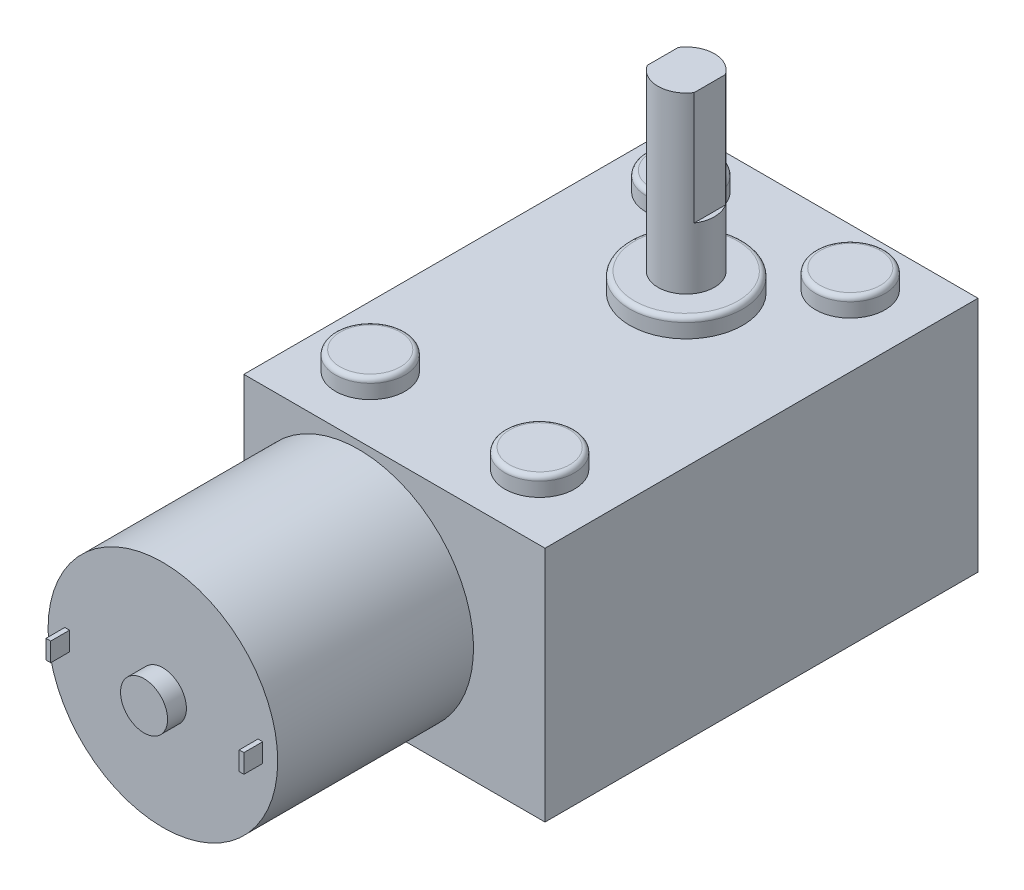
ISO-10303-21;
HEADER;
FILE_DESCRIPTION(('STEP AP214'),'2;1');
FILE_NAME('part.step','',(''),(''),'','','');
FILE_SCHEMA(('AUTOMOTIVE_DESIGN { 1 0 10303 214 1 1 1 1 }'));
ENDSEC;
DATA;
#1=APPLICATION_CONTEXT('core data for automotive mechanical design processes');
#2=APPLICATION_PROTOCOL_DEFINITION('international standard','automotive_design',2000,#1);
#3=PRODUCT_CONTEXT('',#1,'mechanical');
#4=PRODUCT('Part','Part','',(#3));
#5=PRODUCT_RELATED_PRODUCT_CATEGORY('part','',(#4));
#6=PRODUCT_DEFINITION_FORMATION('','',#4);
#7=PRODUCT_DEFINITION_CONTEXT('part definition',#1,'design');
#8=PRODUCT_DEFINITION('design','',#6,#7);
#9=PRODUCT_DEFINITION_SHAPE('','',#8);
#10=(LENGTH_UNIT() NAMED_UNIT(*) SI_UNIT(.MILLI.,.METRE.));
#11=(NAMED_UNIT(*) PLANE_ANGLE_UNIT() SI_UNIT($,.RADIAN.));
#12=(NAMED_UNIT(*) SI_UNIT($,.STERADIAN.) SOLID_ANGLE_UNIT());
#13=UNCERTAINTY_MEASURE_WITH_UNIT(LENGTH_MEASURE(1.E-05),#10,'distance_accuracy_value','');
#14=(GEOMETRIC_REPRESENTATION_CONTEXT(3) GLOBAL_UNCERTAINTY_ASSIGNED_CONTEXT((#13)) GLOBAL_UNIT_ASSIGNED_CONTEXT((#10,
#11,#12)) REPRESENTATION_CONTEXT('',''));
#15=CARTESIAN_POINT('',(0.,0.,0.));
#16=DIRECTION('',(0.,0.,1.));
#17=DIRECTION('',(1.,0.,0.));
#18=AXIS2_PLACEMENT_3D('',#15,#16,#17);
#19=CARTESIAN_POINT('',(-3.8,12.2,43.8));
#20=DIRECTION('',(0.,0.,1.));
#21=DIRECTION('',(1.,0.,0.));
#22=AXIS2_PLACEMENT_3D('',#19,#20,#21);
#23=PLANE('',#22);
#24=CARTESIAN_POINT('',(-3.8,12.2,43.8));
#25=DIRECTION('',(0.,0.,1.));
#26=DIRECTION('',(1.,0.,0.));
#27=AXIS2_PLACEMENT_3D('',#24,#25,#26);
#28=CIRCLE('',#27,2.5);
#29=CARTESIAN_POINT('',(-1.3,12.2,43.8));
#30=VERTEX_POINT('',#29);
#31=EDGE_CURVE('E194',#30,#30,#28,.T.);
#32=ORIENTED_EDGE('',*,*,#31,.F.);
#33=EDGE_LOOP('',(#32));
#34=FACE_BOUND('',#33,.T.);
#35=CARTESIAN_POINT('',(-3.8,12.2,43.8));
#36=DIRECTION('',(0.,0.,1.));
#37=DIRECTION('',(1.,0.,0.));
#38=AXIS2_PLACEMENT_3D('',#35,#36,#37);
#39=CIRCLE('',#38,12.2);
#40=CARTESIAN_POINT('',(8.4,12.2,43.8));
#41=VERTEX_POINT('',#40);
#42=EDGE_CURVE('E260',#41,#41,#39,.T.);
#43=ORIENTED_EDGE('',*,*,#42,.T.);
#44=EDGE_LOOP('',(#43));
#45=FACE_BOUND('',#44,.T.);
#46=DIRECTION('',(-1.,0.,0.));
#47=VECTOR('',#46,1.);
#48=CARTESIAN_POINT('',(6.30931544146247,13.2,43.8));
#49=LINE('',#48,#47);
#50=CARTESIAN_POINT('',(6.80931544146247,13.2,43.8));
#51=VERTEX_POINT('',#50);
#52=CARTESIAN_POINT('',(6.30931544146247,13.2,43.8));
#53=VERTEX_POINT('',#52);
#54=EDGE_CURVE('E238',#51,#53,#49,.T.);
#55=ORIENTED_EDGE('',*,*,#54,.F.);
#56=DIRECTION('',(0.,1.,0.));
#57=VECTOR('',#56,1.);
#58=CARTESIAN_POINT('',(6.80931544146247,13.2,43.8));
#59=LINE('',#58,#57);
#60=CARTESIAN_POINT('',(6.80931544146247,11.2,43.8));
#61=VERTEX_POINT('',#60);
#62=EDGE_CURVE('E224',#61,#51,#59,.T.);
#63=ORIENTED_EDGE('',*,*,#62,.F.);
#64=DIRECTION('',(1.,0.,0.));
#65=VECTOR('',#64,1.);
#66=CARTESIAN_POINT('',(6.30931544146247,11.2,43.8));
#67=LINE('',#66,#65);
#68=CARTESIAN_POINT('',(6.30931544146247,11.2,43.8));
#69=VERTEX_POINT('',#68);
#70=EDGE_CURVE('E229',#69,#61,#67,.T.);
#71=ORIENTED_EDGE('',*,*,#70,.F.);
#72=DIRECTION('',(0.,-1.,0.));
#73=VECTOR('',#72,1.);
#74=CARTESIAN_POINT('',(6.30931544146247,13.2,43.8));
#75=LINE('',#74,#73);
#76=EDGE_CURVE('E240',#53,#69,#75,.T.);
#77=ORIENTED_EDGE('',*,*,#76,.F.);
#78=EDGE_LOOP('',(#55,#63,#71,#77));
#79=FACE_BOUND('',#78,.T.);
#80=DIRECTION('',(1.,0.,0.));
#81=VECTOR('',#80,1.);
#82=CARTESIAN_POINT('',(-13.7180081843051,11.2,43.8));
#83=LINE('',#82,#81);
#84=CARTESIAN_POINT('',(-14.2180081843051,11.2,43.8));
#85=VERTEX_POINT('',#84);
#86=CARTESIAN_POINT('',(-13.7180081843051,11.2,43.8));
#87=VERTEX_POINT('',#86);
#88=EDGE_CURVE('E209',#85,#87,#83,.T.);
#89=ORIENTED_EDGE('',*,*,#88,.F.);
#90=DIRECTION('',(0.,-1.,0.));
#91=VECTOR('',#90,1.);
#92=CARTESIAN_POINT('',(-14.2180081843051,13.2,43.8));
#93=LINE('',#92,#91);
#94=CARTESIAN_POINT('',(-14.2180081843051,13.2,43.8));
#95=VERTEX_POINT('',#94);
#96=EDGE_CURVE('E206',#95,#85,#93,.T.);
#97=ORIENTED_EDGE('',*,*,#96,.F.);
#98=DIRECTION('',(-1.,0.,0.));
#99=VECTOR('',#98,1.);
#100=CARTESIAN_POINT('',(-13.7180081843051,13.2,43.8));
#101=LINE('',#100,#99);
#102=CARTESIAN_POINT('',(-13.7180081843051,13.2,43.8));
#103=VERTEX_POINT('',#102);
#104=EDGE_CURVE('E199',#103,#95,#101,.T.);
#105=ORIENTED_EDGE('',*,*,#104,.F.);
#106=DIRECTION('',(0.,1.,0.));
#107=VECTOR('',#106,1.);
#108=CARTESIAN_POINT('',(-13.7180081843051,13.2,43.8));
#109=LINE('',#108,#107);
#110=EDGE_CURVE('E211',#87,#103,#109,.T.);
#111=ORIENTED_EDGE('',*,*,#110,.F.);
#112=EDGE_LOOP('',(#89,#97,#105,#111));
#113=FACE_BOUND('',#112,.T.);
#114=ADVANCED_FACE('F36',(#34,#45,#79,#113),#23,.T.);
#115=CARTESIAN_POINT('',(0.,25.2,23.));
#116=DIRECTION('',(0.,0.,-1.));
#117=DIRECTION('',(-1.,0.,0.));
#118=AXIS2_PLACEMENT_3D('',#115,#116,#117);
#119=PLANE('',#118);
#120=CARTESIAN_POINT('',(-3.8,12.2,23.));
#121=DIRECTION('',(0.,0.,1.));
#122=DIRECTION('',(1.,0.,0.));
#123=AXIS2_PLACEMENT_3D('',#120,#121,#122);
#124=CIRCLE('',#123,12.2);
#125=CARTESIAN_POINT('',(-16.,12.2,23.));
#126=VERTEX_POINT('',#125);
#127=CARTESIAN_POINT('',(-3.8,0.,23.));
#128=VERTEX_POINT('',#127);
#129=EDGE_CURVE('E256',#126,#128,#124,.T.);
#130=ORIENTED_EDGE('',*,*,#129,.F.);
#131=DIRECTION('',(0.,-1.,0.));
#132=VECTOR('',#131,1.);
#133=CARTESIAN_POINT('',(-16.,25.2,23.));
#134=LINE('',#133,#132);
#135=CARTESIAN_POINT('',(-16.,0.,23.));
#136=VERTEX_POINT('',#135);
#137=EDGE_CURVE('E293',#126,#136,#134,.T.);
#138=ORIENTED_EDGE('',*,*,#137,.T.);
#139=DIRECTION('',(1.,0.,0.));
#140=VECTOR('',#139,1.);
#141=CARTESIAN_POINT('',(0.,0.,23.));
#142=LINE('',#141,#140);
#143=EDGE_CURVE('E294',#136,#128,#142,.T.);
#144=ORIENTED_EDGE('',*,*,#143,.T.);
#145=EDGE_LOOP('',(#130,#138,#144));
#146=FACE_BOUND('',#145,.T.);
#147=ADVANCED_FACE('F351',(#146),#119,.F.);
#148=EDGE_CURVE('E259',#128,#126,#124,.T.);
#149=ORIENTED_EDGE('',*,*,#148,.F.);
#150=CARTESIAN_POINT('',(16.,0.,23.));
#151=VERTEX_POINT('',#150);
#152=EDGE_CURVE('E280',#128,#151,#142,.T.);
#153=ORIENTED_EDGE('',*,*,#152,.T.);
#154=DIRECTION('',(0.,-1.,0.));
#155=VECTOR('',#154,1.);
#156=CARTESIAN_POINT('',(16.,25.2,23.));
#157=LINE('',#156,#155);
#158=CARTESIAN_POINT('',(16.,25.2,23.));
#159=VERTEX_POINT('',#158);
#160=EDGE_CURVE('E311',#159,#151,#157,.T.);
#161=ORIENTED_EDGE('',*,*,#160,.F.);
#162=DIRECTION('',(1.,0.,0.));
#163=VECTOR('',#162,1.);
#164=CARTESIAN_POINT('',(0.,25.2,23.));
#165=LINE('',#164,#163);
#166=CARTESIAN_POINT('',(-16.,25.2,23.));
#167=VERTEX_POINT('',#166);
#168=EDGE_CURVE('E281',#167,#159,#165,.T.);
#169=ORIENTED_EDGE('',*,*,#168,.F.);
#170=EDGE_CURVE('E305',#167,#126,#134,.T.);
#171=ORIENTED_EDGE('',*,*,#170,.T.);
#172=EDGE_LOOP('',(#149,#153,#161,#169,#171));
#173=FACE_BOUND('',#172,.T.);
#174=ADVANCED_FACE('F357',(#173),#119,.F.);
#175=CARTESIAN_POINT('',(16.,25.2,0.));
#176=DIRECTION('',(-1.,0.,0.));
#177=DIRECTION('',(0.,0.,1.));
#178=AXIS2_PLACEMENT_3D('',#175,#176,#177);
#179=PLANE('',#178);
#180=DIRECTION('',(0.,0.,-1.));
#181=VECTOR('',#180,1.);
#182=CARTESIAN_POINT('',(16.,0.,0.));
#183=LINE('',#182,#181);
#184=CARTESIAN_POINT('',(16.,0.,-23.));
#185=VERTEX_POINT('',#184);
#186=EDGE_CURVE('E297',#151,#185,#183,.T.);
#187=ORIENTED_EDGE('',*,*,#186,.T.);
#188=DIRECTION('',(0.,-1.,0.));
#189=VECTOR('',#188,1.);
#190=CARTESIAN_POINT('',(16.,25.2,-23.));
#191=LINE('',#190,#189);
#192=CARTESIAN_POINT('',(16.,25.2,-23.));
#193=VERTEX_POINT('',#192);
#194=EDGE_CURVE('E309',#193,#185,#191,.T.);
#195=ORIENTED_EDGE('',*,*,#194,.F.);
#196=DIRECTION('',(0.,0.,-1.));
#197=VECTOR('',#196,1.);
#198=CARTESIAN_POINT('',(16.,25.2,0.));
#199=LINE('',#198,#197);
#200=EDGE_CURVE('E284',#159,#193,#199,.T.);
#201=ORIENTED_EDGE('',*,*,#200,.F.);
#202=ORIENTED_EDGE('',*,*,#160,.T.);
#203=EDGE_LOOP('',(#187,#195,#201,#202));
#204=FACE_BOUND('',#203,.T.);
#205=ADVANCED_FACE('F423',(#204),#179,.F.);
#206=CARTESIAN_POINT('',(0.,25.2,-23.));
#207=DIRECTION('',(0.,0.,-1.));
#208=DIRECTION('',(-1.,0.,0.));
#209=AXIS2_PLACEMENT_3D('',#206,#207,#208);
#210=PLANE('',#209);
#211=DIRECTION('',(1.,0.,0.));
#212=VECTOR('',#211,1.);
#213=CARTESIAN_POINT('',(0.,0.,-23.));
#214=LINE('',#213,#212);
#215=CARTESIAN_POINT('',(-16.,0.,-23.));
#216=VERTEX_POINT('',#215);
#217=EDGE_CURVE('E300',#216,#185,#214,.T.);
#218=ORIENTED_EDGE('',*,*,#217,.F.);
#219=DIRECTION('',(0.,-1.,0.));
#220=VECTOR('',#219,1.);
#221=CARTESIAN_POINT('',(-16.,25.2,-23.));
#222=LINE('',#221,#220);
#223=CARTESIAN_POINT('',(-16.,25.2,-23.));
#224=VERTEX_POINT('',#223);
#225=EDGE_CURVE('E307',#224,#216,#222,.T.);
#226=ORIENTED_EDGE('',*,*,#225,.F.);
#227=DIRECTION('',(1.,0.,0.));
#228=VECTOR('',#227,1.);
#229=CARTESIAN_POINT('',(0.,25.2,-23.));
#230=LINE('',#229,#228);
#231=EDGE_CURVE('E287',#224,#193,#230,.T.);
#232=ORIENTED_EDGE('',*,*,#231,.T.);
#233=ORIENTED_EDGE('',*,*,#194,.T.);
#234=EDGE_LOOP('',(#218,#226,#232,#233));
#235=FACE_BOUND('',#234,.T.);
#236=ADVANCED_FACE('F419',(#235),#210,.T.);
#237=CARTESIAN_POINT('',(-16.,25.2,0.));
#238=DIRECTION('',(-1.,0.,0.));
#239=DIRECTION('',(0.,0.,1.));
#240=AXIS2_PLACEMENT_3D('',#237,#238,#239);
#241=PLANE('',#240);
#242=DIRECTION('',(0.,0.,-1.));
#243=VECTOR('',#242,1.);
#244=CARTESIAN_POINT('',(-16.,0.,0.));
#245=LINE('',#244,#243);
#246=EDGE_CURVE('E285',#136,#216,#245,.T.);
#247=ORIENTED_EDGE('',*,*,#246,.F.);
#248=ORIENTED_EDGE('',*,*,#137,.F.);
#249=ORIENTED_EDGE('',*,*,#170,.F.);
#250=DIRECTION('',(0.,0.,-1.));
#251=VECTOR('',#250,1.);
#252=CARTESIAN_POINT('',(-16.,25.2,0.));
#253=LINE('',#252,#251);
#254=EDGE_CURVE('E290',#167,#224,#253,.T.);
#255=ORIENTED_EDGE('',*,*,#254,.T.);
#256=ORIENTED_EDGE('',*,*,#225,.T.);
#257=EDGE_LOOP('',(#247,#248,#249,#255,#256));
#258=FACE_BOUND('',#257,.T.);
#259=ADVANCED_FACE('F412',(#258),#241,.T.);
#260=CARTESIAN_POINT('',(0.,25.2,0.));
#261=DIRECTION('',(0.,1.,0.));
#262=DIRECTION('',(0.,0.,1.));
#263=AXIS2_PLACEMENT_3D('',#260,#261,#262);
#264=PLANE('',#263);
#265=CARTESIAN_POINT('',(0.,25.2,-8.));
#266=DIRECTION('',(0.,1.,0.));
#267=DIRECTION('',(0.,0.,1.));
#268=AXIS2_PLACEMENT_3D('',#265,#266,#267);
#269=CIRCLE('',#268,6.);
#270=CARTESIAN_POINT('',(0.,25.2,-2.));
#271=VERTEX_POINT('',#270);
#272=EDGE_CURVE('E263',#271,#271,#269,.T.);
#273=ORIENTED_EDGE('',*,*,#272,.F.);
#274=EDGE_LOOP('',(#273));
#275=FACE_BOUND('',#274,.T.);
#276=CARTESIAN_POINT('',(-9.56913183279743,25.2,16.));
#277=DIRECTION('',(0.,1.,0.));
#278=DIRECTION('',(0.,0.,1.));
#279=AXIS2_PLACEMENT_3D('',#276,#277,#278);
#280=CIRCLE('',#279,3.7);
#281=CARTESIAN_POINT('',(-9.56913183279743,25.2,19.7));
#282=VERTEX_POINT('',#281);
#283=EDGE_CURVE('E268',#282,#282,#280,.T.);
#284=ORIENTED_EDGE('',*,*,#283,.F.);
#285=EDGE_LOOP('',(#284));
#286=FACE_BOUND('',#285,.T.);
#287=CARTESIAN_POINT('',(8.43086816720256,25.2,16.));
#288=DIRECTION('',(0.,1.,0.));
#289=DIRECTION('',(0.,0.,1.));
#290=AXIS2_PLACEMENT_3D('',#287,#288,#289);
#291=CIRCLE('',#290,3.7);
#292=CARTESIAN_POINT('',(8.43086816720256,25.2,19.7));
#293=VERTEX_POINT('',#292);
#294=EDGE_CURVE('E271',#293,#293,#291,.T.);
#295=ORIENTED_EDGE('',*,*,#294,.F.);
#296=EDGE_LOOP('',(#295));
#297=FACE_BOUND('',#296,.T.);
#298=CARTESIAN_POINT('',(8.43086816720256,25.2,-17.));
#299=DIRECTION('',(0.,1.,0.));
#300=DIRECTION('',(0.,0.,1.));
#301=AXIS2_PLACEMENT_3D('',#298,#299,#300);
#302=CIRCLE('',#301,3.7);
#303=CARTESIAN_POINT('',(8.43086816720256,25.2,-13.3));
#304=VERTEX_POINT('',#303);
#305=EDGE_CURVE('E274',#304,#304,#302,.T.);
#306=ORIENTED_EDGE('',*,*,#305,.F.);
#307=EDGE_LOOP('',(#306));
#308=FACE_BOUND('',#307,.T.);
#309=CARTESIAN_POINT('',(-9.56913183279743,25.2,-17.));
#310=DIRECTION('',(0.,1.,0.));
#311=DIRECTION('',(0.,0.,1.));
#312=AXIS2_PLACEMENT_3D('',#309,#310,#311);
#313=CIRCLE('',#312,3.7);
#314=CARTESIAN_POINT('',(-9.56913183279743,25.2,-13.3));
#315=VERTEX_POINT('',#314);
#316=EDGE_CURVE('E277',#315,#315,#313,.T.);
#317=ORIENTED_EDGE('',*,*,#316,.F.);
#318=EDGE_LOOP('',(#317));
#319=FACE_BOUND('',#318,.T.);
#320=ORIENTED_EDGE('',*,*,#168,.T.);
#321=ORIENTED_EDGE('',*,*,#200,.T.);
#322=ORIENTED_EDGE('',*,*,#231,.F.);
#323=ORIENTED_EDGE('',*,*,#254,.F.);
#324=EDGE_LOOP('',(#320,#321,#322,#323));
#325=FACE_BOUND('',#324,.T.);
#326=ADVANCED_FACE('F409',(#275,#286,#297,#308,#319,#325),#264,.T.);
#327=CARTESIAN_POINT('',(0.,0.,0.));
#328=DIRECTION('',(0.,1.,0.));
#329=DIRECTION('',(0.,0.,1.));
#330=AXIS2_PLACEMENT_3D('',#327,#328,#329);
#331=PLANE('',#330);
#332=ORIENTED_EDGE('',*,*,#143,.F.);
#333=ORIENTED_EDGE('',*,*,#246,.T.);
#334=ORIENTED_EDGE('',*,*,#217,.T.);
#335=ORIENTED_EDGE('',*,*,#186,.F.);
#336=ORIENTED_EDGE('',*,*,#152,.F.);
#337=EDGE_LOOP('',(#332,#333,#334,#335,#336));
#338=FACE_BOUND('',#337,.T.);
#339=ADVANCED_FACE('F407',(#338),#331,.F.);
#340=CARTESIAN_POINT('',(-9.56913183279743,27.2,-17.));
#341=DIRECTION('',(0.,-1.,0.));
#342=DIRECTION('',(0.,0.,-1.));
#343=AXIS2_PLACEMENT_3D('',#340,#341,#342);
#344=CYLINDRICAL_SURFACE('',#343,3.7);
#345=CARTESIAN_POINT('',(-9.56913183279743,26.7,-17.));
#346=DIRECTION('',(0.,1.,0.));
#347=DIRECTION('',(0.,0.,1.));
#348=AXIS2_PLACEMENT_3D('',#345,#346,#347);
#349=CIRCLE('',#348,3.7);
#350=CARTESIAN_POINT('',(-9.56913183279743,26.7,-13.3));
#351=VERTEX_POINT('',#350);
#352=EDGE_CURVE('E316',#351,#351,#349,.F.);
#353=ORIENTED_EDGE('',*,*,#352,.T.);
#354=EDGE_LOOP('',(#353));
#355=FACE_BOUND('',#354,.T.);
#356=ORIENTED_EDGE('',*,*,#316,.T.);
#357=EDGE_LOOP('',(#356));
#358=FACE_BOUND('',#357,.T.);
#359=ADVANCED_FACE('F403',(#355,#358),#344,.T.);
#360=CARTESIAN_POINT('',(-9.56913183279743,27.2,-17.));
#361=DIRECTION('',(0.,1.,0.));
#362=DIRECTION('',(0.,0.,1.));
#363=AXIS2_PLACEMENT_3D('',#360,#361,#362);
#364=PLANE('',#363);
#365=CARTESIAN_POINT('',(-9.56913183279743,27.2,-17.));
#366=DIRECTION('',(0.,1.,0.));
#367=DIRECTION('',(0.,0.,1.));
#368=AXIS2_PLACEMENT_3D('',#365,#366,#367);
#369=CIRCLE('',#368,3.2);
#370=CARTESIAN_POINT('',(-9.56913183279743,27.2,-13.8));
#371=VERTEX_POINT('',#370);
#372=EDGE_CURVE('E193',#371,#371,#369,.T.);
#373=ORIENTED_EDGE('',*,*,#372,.T.);
#374=EDGE_LOOP('',(#373));
#375=FACE_BOUND('',#374,.T.);
#376=ADVANCED_FACE('F399',(#375),#364,.T.);
#377=CARTESIAN_POINT('',(8.43086816720256,27.2,-17.));
#378=DIRECTION('',(0.,-1.,0.));
#379=DIRECTION('',(0.,0.,-1.));
#380=AXIS2_PLACEMENT_3D('',#377,#378,#379);
#381=CYLINDRICAL_SURFACE('',#380,3.7);
#382=CARTESIAN_POINT('',(8.43086816720256,26.7,-17.));
#383=DIRECTION('',(0.,1.,0.));
#384=DIRECTION('',(0.,0.,1.));
#385=AXIS2_PLACEMENT_3D('',#382,#383,#384);
#386=CIRCLE('',#385,3.7);
#387=CARTESIAN_POINT('',(8.43086816720256,26.7,-13.3));
#388=VERTEX_POINT('',#387);
#389=EDGE_CURVE('E322',#388,#388,#386,.F.);
#390=ORIENTED_EDGE('',*,*,#389,.T.);
#391=EDGE_LOOP('',(#390));
#392=FACE_BOUND('',#391,.T.);
#393=ORIENTED_EDGE('',*,*,#305,.T.);
#394=EDGE_LOOP('',(#393));
#395=FACE_BOUND('',#394,.T.);
#396=ADVANCED_FACE('F395',(#392,#395),#381,.T.);
#397=CARTESIAN_POINT('',(8.43086816720256,27.2,-17.));
#398=DIRECTION('',(0.,1.,0.));
#399=DIRECTION('',(0.,0.,1.));
#400=AXIS2_PLACEMENT_3D('',#397,#398,#399);
#401=PLANE('',#400);
#402=CARTESIAN_POINT('',(8.43086816720256,27.2,-17.));
#403=DIRECTION('',(0.,1.,0.));
#404=DIRECTION('',(0.,0.,1.));
#405=AXIS2_PLACEMENT_3D('',#402,#403,#404);
#406=CIRCLE('',#405,3.2);
#407=CARTESIAN_POINT('',(8.43086816720256,27.2,-13.8));
#408=VERTEX_POINT('',#407);
#409=EDGE_CURVE('E319',#408,#408,#406,.T.);
#410=ORIENTED_EDGE('',*,*,#409,.T.);
#411=EDGE_LOOP('',(#410));
#412=FACE_BOUND('',#411,.T.);
#413=ADVANCED_FACE('F391',(#412),#401,.T.);
#414=CARTESIAN_POINT('',(8.43086816720256,27.2,16.));
#415=DIRECTION('',(0.,-1.,0.));
#416=DIRECTION('',(0.,0.,-1.));
#417=AXIS2_PLACEMENT_3D('',#414,#415,#416);
#418=CYLINDRICAL_SURFACE('',#417,3.7);
#419=CARTESIAN_POINT('',(8.43086816720256,26.7,16.));
#420=DIRECTION('',(0.,1.,0.));
#421=DIRECTION('',(0.,0.,1.));
#422=AXIS2_PLACEMENT_3D('',#419,#420,#421);
#423=CIRCLE('',#422,3.7);
#424=CARTESIAN_POINT('',(8.43086816720256,26.7,19.7));
#425=VERTEX_POINT('',#424);
#426=EDGE_CURVE('E11',#425,#425,#423,.F.);
#427=ORIENTED_EDGE('',*,*,#426,.T.);
#428=EDGE_LOOP('',(#427));
#429=FACE_BOUND('',#428,.T.);
#430=ORIENTED_EDGE('',*,*,#294,.T.);
#431=EDGE_LOOP('',(#430));
#432=FACE_BOUND('',#431,.T.);
#433=ADVANCED_FACE('F388',(#429,#432),#418,.T.);
#434=CARTESIAN_POINT('',(8.43086816720256,27.2,16.));
#435=DIRECTION('',(0.,1.,0.));
#436=DIRECTION('',(0.,0.,1.));
#437=AXIS2_PLACEMENT_3D('',#434,#435,#436);
#438=PLANE('',#437);
#439=CARTESIAN_POINT('',(8.43086816720256,27.2,16.));
#440=DIRECTION('',(0.,1.,0.));
#441=DIRECTION('',(0.,0.,1.));
#442=AXIS2_PLACEMENT_3D('',#439,#440,#441);
#443=CIRCLE('',#442,3.2);
#444=CARTESIAN_POINT('',(8.43086816720256,27.2,19.2));
#445=VERTEX_POINT('',#444);
#446=EDGE_CURVE('E44',#445,#445,#443,.T.);
#447=ORIENTED_EDGE('',*,*,#446,.T.);
#448=EDGE_LOOP('',(#447));
#449=FACE_BOUND('',#448,.T.);
#450=ADVANCED_FACE('F339',(#449),#438,.T.);
#451=CARTESIAN_POINT('',(-9.56913183279743,27.2,16.));
#452=DIRECTION('',(0.,-1.,0.));
#453=DIRECTION('',(0.,0.,-1.));
#454=AXIS2_PLACEMENT_3D('',#451,#452,#453);
#455=CYLINDRICAL_SURFACE('',#454,3.7);
#456=CARTESIAN_POINT('',(-9.56913183279743,26.7,16.));
#457=DIRECTION('',(0.,1.,0.));
#458=DIRECTION('',(0.,0.,1.));
#459=AXIS2_PLACEMENT_3D('',#456,#457,#458);
#460=CIRCLE('',#459,3.7);
#461=CARTESIAN_POINT('',(-9.56913183279743,26.7,19.7));
#462=VERTEX_POINT('',#461);
#463=EDGE_CURVE('E334',#462,#462,#460,.F.);
#464=ORIENTED_EDGE('',*,*,#463,.T.);
#465=EDGE_LOOP('',(#464));
#466=FACE_BOUND('',#465,.T.);
#467=ORIENTED_EDGE('',*,*,#283,.T.);
#468=EDGE_LOOP('',(#467));
#469=FACE_BOUND('',#468,.T.);
#470=ADVANCED_FACE('F381',(#466,#469),#455,.T.);
#471=CARTESIAN_POINT('',(-9.56913183279743,27.2,16.));
#472=DIRECTION('',(0.,1.,0.));
#473=DIRECTION('',(0.,0.,1.));
#474=AXIS2_PLACEMENT_3D('',#471,#472,#473);
#475=PLANE('',#474);
#476=CARTESIAN_POINT('',(-9.56913183279743,27.2,16.));
#477=DIRECTION('',(0.,1.,0.));
#478=DIRECTION('',(0.,0.,1.));
#479=AXIS2_PLACEMENT_3D('',#476,#477,#478);
#480=CIRCLE('',#479,3.2);
#481=CARTESIAN_POINT('',(-9.56913183279743,27.2,19.2));
#482=VERTEX_POINT('',#481);
#483=EDGE_CURVE('E331',#482,#482,#480,.T.);
#484=ORIENTED_EDGE('',*,*,#483,.T.);
#485=EDGE_LOOP('',(#484));
#486=FACE_BOUND('',#485,.T.);
#487=ADVANCED_FACE('F377',(#486),#475,.T.);
#488=CARTESIAN_POINT('',(0.,27.2,-8.));
#489=DIRECTION('',(0.,-1.,0.));
#490=DIRECTION('',(0.,0.,-1.));
#491=AXIS2_PLACEMENT_3D('',#488,#489,#490);
#492=CYLINDRICAL_SURFACE('',#491,6.);
#493=CARTESIAN_POINT('',(0.,26.7,-8.));
#494=DIRECTION('',(0.,1.,0.));
#495=DIRECTION('',(0.,0.,1.));
#496=AXIS2_PLACEMENT_3D('',#493,#494,#495);
#497=CIRCLE('',#496,6.);
#498=CARTESIAN_POINT('',(0.,26.7,-2.));
#499=VERTEX_POINT('',#498);
#500=EDGE_CURVE('E328',#499,#499,#497,.F.);
#501=ORIENTED_EDGE('',*,*,#500,.T.);
#502=EDGE_LOOP('',(#501));
#503=FACE_BOUND('',#502,.T.);
#504=ORIENTED_EDGE('',*,*,#272,.T.);
#505=EDGE_LOOP('',(#504));
#506=FACE_BOUND('',#505,.T.);
#507=ADVANCED_FACE('F373',(#503,#506),#492,.T.);
#508=CARTESIAN_POINT('',(0.,27.2,-8.));
#509=DIRECTION('',(0.,1.,0.));
#510=DIRECTION('',(0.,0.,1.));
#511=AXIS2_PLACEMENT_3D('',#508,#509,#510);
#512=PLANE('',#511);
#513=CARTESIAN_POINT('',(0.,27.2,-8.));
#514=DIRECTION('',(0.,1.,0.));
#515=DIRECTION('',(0.,0.,1.));
#516=AXIS2_PLACEMENT_3D('',#513,#514,#515);
#517=CIRCLE('',#516,5.5);
#518=CARTESIAN_POINT('',(0.,27.2,-2.5));
#519=VERTEX_POINT('',#518);
#520=EDGE_CURVE('E325',#519,#519,#517,.T.);
#521=ORIENTED_EDGE('',*,*,#520,.T.);
#522=EDGE_LOOP('',(#521));
#523=FACE_BOUND('',#522,.T.);
#524=CARTESIAN_POINT('',(0.,27.2,-8.));
#525=DIRECTION('',(0.,1.,0.));
#526=DIRECTION('',(0.,0.,1.));
#527=AXIS2_PLACEMENT_3D('',#524,#525,#526);
#528=CIRCLE('',#527,3.);
#529=CARTESIAN_POINT('',(0.,27.2,-5.));
#530=VERTEX_POINT('',#529);
#531=EDGE_CURVE('E190',#530,#530,#528,.T.);
#532=ORIENTED_EDGE('',*,*,#531,.F.);
#533=EDGE_LOOP('',(#532));
#534=FACE_BOUND('',#533,.T.);
#535=ADVANCED_FACE('F369',(#523,#534),#512,.T.);
#536=CARTESIAN_POINT('',(-3.8,12.2,43.8));
#537=DIRECTION('',(0.,0.,-1.));
#538=DIRECTION('',(-1.,0.,0.));
#539=AXIS2_PLACEMENT_3D('',#536,#537,#538);
#540=CYLINDRICAL_SURFACE('',#539,12.2);
#541=ORIENTED_EDGE('',*,*,#42,.F.);
#542=EDGE_LOOP('',(#541));
#543=FACE_BOUND('',#542,.T.);
#544=ORIENTED_EDGE('',*,*,#129,.T.);
#545=ORIENTED_EDGE('',*,*,#148,.T.);
#546=EDGE_LOOP('',(#544,#545));
#547=FACE_BOUND('',#546,.T.);
#548=ADVANCED_FACE('F366',(#543,#547),#540,.T.);
#549=CARTESIAN_POINT('',(-3.8,12.2,45.8));
#550=DIRECTION('',(0.,0.,-1.));
#551=DIRECTION('',(-1.,0.,0.));
#552=AXIS2_PLACEMENT_3D('',#549,#550,#551);
#553=CYLINDRICAL_SURFACE('',#552,2.5);
#554=CARTESIAN_POINT('',(-3.8,12.2,45.8));
#555=DIRECTION('',(0.,0.,1.));
#556=DIRECTION('',(1.,0.,0.));
#557=AXIS2_PLACEMENT_3D('',#554,#555,#556);
#558=CIRCLE('',#557,2.5);
#559=CARTESIAN_POINT('',(-1.3,12.2,45.8));
#560=VERTEX_POINT('',#559);
#561=EDGE_CURVE('E253',#560,#560,#558,.T.);
#562=ORIENTED_EDGE('',*,*,#561,.F.);
#563=EDGE_LOOP('',(#562));
#564=FACE_BOUND('',#563,.T.);
#565=ORIENTED_EDGE('',*,*,#31,.T.);
#566=EDGE_LOOP('',(#565));
#567=FACE_BOUND('',#566,.T.);
#568=ADVANCED_FACE('F364',(#564,#567),#553,.T.);
#569=CARTESIAN_POINT('',(-3.8,12.2,45.8));
#570=DIRECTION('',(0.,0.,1.));
#571=DIRECTION('',(1.,0.,0.));
#572=AXIS2_PLACEMENT_3D('',#569,#570,#571);
#573=PLANE('',#572);
#574=ORIENTED_EDGE('',*,*,#561,.T.);
#575=EDGE_LOOP('',(#574));
#576=FACE_BOUND('',#575,.T.);
#577=ADVANCED_FACE('F496',(#576),#573,.T.);
#578=CARTESIAN_POINT('',(6.80931544146247,13.2,45.8));
#579=DIRECTION('',(-1.,0.,0.));
#580=DIRECTION('',(0.,0.,1.));
#581=AXIS2_PLACEMENT_3D('',#578,#579,#580);
#582=PLANE('',#581);
#583=ORIENTED_EDGE('',*,*,#62,.T.);
#584=DIRECTION('',(0.,0.,-1.));
#585=VECTOR('',#584,1.);
#586=CARTESIAN_POINT('',(6.80931544146247,13.2,45.8));
#587=LINE('',#586,#585);
#588=CARTESIAN_POINT('',(6.80931544146247,13.2,45.8));
#589=VERTEX_POINT('',#588);
#590=EDGE_CURVE('E251',#589,#51,#587,.T.);
#591=ORIENTED_EDGE('',*,*,#590,.F.);
#592=DIRECTION('',(0.,1.,0.));
#593=VECTOR('',#592,1.);
#594=CARTESIAN_POINT('',(6.80931544146247,13.2,45.8));
#595=LINE('',#594,#593);
#596=CARTESIAN_POINT('',(6.80931544146247,11.2,45.8));
#597=VERTEX_POINT('',#596);
#598=EDGE_CURVE('E225',#597,#589,#595,.T.);
#599=ORIENTED_EDGE('',*,*,#598,.F.);
#600=DIRECTION('',(0.,0.,-1.));
#601=VECTOR('',#600,1.);
#602=CARTESIAN_POINT('',(6.80931544146247,11.2,45.8));
#603=LINE('',#602,#601);
#604=EDGE_CURVE('E235',#597,#61,#603,.T.);
#605=ORIENTED_EDGE('',*,*,#604,.T.);
#606=EDGE_LOOP('',(#583,#591,#599,#605));
#607=FACE_BOUND('',#606,.T.);
#608=ADVANCED_FACE('F493',(#607),#582,.F.);
#609=CARTESIAN_POINT('',(6.30931544146247,13.2,45.8));
#610=DIRECTION('',(0.,-1.,0.));
#611=DIRECTION('',(0.,0.,-1.));
#612=AXIS2_PLACEMENT_3D('',#609,#610,#611);
#613=PLANE('',#612);
#614=ORIENTED_EDGE('',*,*,#54,.T.);
#615=DIRECTION('',(0.,0.,-1.));
#616=VECTOR('',#615,1.);
#617=CARTESIAN_POINT('',(6.30931544146247,13.2,45.8));
#618=LINE('',#617,#616);
#619=CARTESIAN_POINT('',(6.30931544146247,13.2,45.8));
#620=VERTEX_POINT('',#619);
#621=EDGE_CURVE('E248',#620,#53,#618,.T.);
#622=ORIENTED_EDGE('',*,*,#621,.F.);
#623=DIRECTION('',(-1.,0.,0.));
#624=VECTOR('',#623,1.);
#625=CARTESIAN_POINT('',(6.30931544146247,13.2,45.8));
#626=LINE('',#625,#624);
#627=EDGE_CURVE('E228',#589,#620,#626,.T.);
#628=ORIENTED_EDGE('',*,*,#627,.F.);
#629=ORIENTED_EDGE('',*,*,#590,.T.);
#630=EDGE_LOOP('',(#614,#622,#628,#629));
#631=FACE_BOUND('',#630,.T.);
#632=ADVANCED_FACE('F489',(#631),#613,.F.);
#633=CARTESIAN_POINT('',(6.30931544146247,13.2,45.8));
#634=DIRECTION('',(1.,0.,0.));
#635=DIRECTION('',(0.,0.,-1.));
#636=AXIS2_PLACEMENT_3D('',#633,#634,#635);
#637=PLANE('',#636);
#638=ORIENTED_EDGE('',*,*,#76,.T.);
#639=DIRECTION('',(0.,0.,-1.));
#640=VECTOR('',#639,1.);
#641=CARTESIAN_POINT('',(6.30931544146247,11.2,45.8));
#642=LINE('',#641,#640);
#643=CARTESIAN_POINT('',(6.30931544146247,11.2,45.8));
#644=VERTEX_POINT('',#643);
#645=EDGE_CURVE('E246',#644,#69,#642,.T.);
#646=ORIENTED_EDGE('',*,*,#645,.F.);
#647=DIRECTION('',(0.,-1.,0.));
#648=VECTOR('',#647,1.);
#649=CARTESIAN_POINT('',(6.30931544146247,13.2,45.8));
#650=LINE('',#649,#648);
#651=EDGE_CURVE('E231',#620,#644,#650,.T.);
#652=ORIENTED_EDGE('',*,*,#651,.F.);
#653=ORIENTED_EDGE('',*,*,#621,.T.);
#654=EDGE_LOOP('',(#638,#646,#652,#653));
#655=FACE_BOUND('',#654,.T.);
#656=ADVANCED_FACE('F485',(#655),#637,.F.);
#657=CARTESIAN_POINT('',(6.30931544146247,11.2,45.8));
#658=DIRECTION('',(0.,1.,0.));
#659=DIRECTION('',(0.,0.,1.));
#660=AXIS2_PLACEMENT_3D('',#657,#658,#659);
#661=PLANE('',#660);
#662=ORIENTED_EDGE('',*,*,#70,.T.);
#663=ORIENTED_EDGE('',*,*,#604,.F.);
#664=DIRECTION('',(1.,0.,0.));
#665=VECTOR('',#664,1.);
#666=CARTESIAN_POINT('',(6.30931544146247,11.2,45.8));
#667=LINE('',#666,#665);
#668=EDGE_CURVE('E233',#644,#597,#667,.T.);
#669=ORIENTED_EDGE('',*,*,#668,.F.);
#670=ORIENTED_EDGE('',*,*,#645,.T.);
#671=EDGE_LOOP('',(#662,#663,#669,#670));
#672=FACE_BOUND('',#671,.T.);
#673=ADVANCED_FACE('F481',(#672),#661,.F.);
#674=CARTESIAN_POINT('',(0.,0.,45.8));
#675=DIRECTION('',(0.,0.,1.));
#676=DIRECTION('',(1.,0.,0.));
#677=AXIS2_PLACEMENT_3D('',#674,#675,#676);
#678=PLANE('',#677);
#679=ORIENTED_EDGE('',*,*,#598,.T.);
#680=ORIENTED_EDGE('',*,*,#627,.T.);
#681=ORIENTED_EDGE('',*,*,#651,.T.);
#682=ORIENTED_EDGE('',*,*,#668,.T.);
#683=EDGE_LOOP('',(#679,#680,#681,#682));
#684=FACE_BOUND('',#683,.T.);
#685=ADVANCED_FACE('F477',(#684),#678,.T.);
#686=CARTESIAN_POINT('',(-14.2180081843051,13.2,45.8));
#687=DIRECTION('',(1.,0.,0.));
#688=DIRECTION('',(0.,0.,-1.));
#689=AXIS2_PLACEMENT_3D('',#686,#687,#688);
#690=PLANE('',#689);
#691=ORIENTED_EDGE('',*,*,#96,.T.);
#692=DIRECTION('',(0.,0.,-1.));
#693=VECTOR('',#692,1.);
#694=CARTESIAN_POINT('',(-14.2180081843051,11.2,45.8));
#695=LINE('',#694,#693);
#696=CARTESIAN_POINT('',(-14.2180081843051,11.2,45.8));
#697=VERTEX_POINT('',#696);
#698=EDGE_CURVE('E222',#697,#85,#695,.T.);
#699=ORIENTED_EDGE('',*,*,#698,.F.);
#700=DIRECTION('',(0.,-1.,0.));
#701=VECTOR('',#700,1.);
#702=CARTESIAN_POINT('',(-14.2180081843051,13.2,45.8));
#703=LINE('',#702,#701);
#704=CARTESIAN_POINT('',(-14.2180081843051,13.2,45.8));
#705=VERTEX_POINT('',#704);
#706=EDGE_CURVE('E195',#705,#697,#703,.T.);
#707=ORIENTED_EDGE('',*,*,#706,.F.);
#708=DIRECTION('',(0.,0.,-1.));
#709=VECTOR('',#708,1.);
#710=CARTESIAN_POINT('',(-14.2180081843051,13.2,45.8));
#711=LINE('',#710,#709);
#712=EDGE_CURVE('E205',#705,#95,#711,.T.);
#713=ORIENTED_EDGE('',*,*,#712,.T.);
#714=EDGE_LOOP('',(#691,#699,#707,#713));
#715=FACE_BOUND('',#714,.T.);
#716=ADVANCED_FACE('F473',(#715),#690,.F.);
#717=CARTESIAN_POINT('',(-13.7180081843051,11.2,45.8));
#718=DIRECTION('',(0.,1.,0.));
#719=DIRECTION('',(0.,0.,1.));
#720=AXIS2_PLACEMENT_3D('',#717,#718,#719);
#721=PLANE('',#720);
#722=ORIENTED_EDGE('',*,*,#88,.T.);
#723=DIRECTION('',(0.,0.,-1.));
#724=VECTOR('',#723,1.);
#725=CARTESIAN_POINT('',(-13.7180081843051,11.2,45.8));
#726=LINE('',#725,#724);
#727=CARTESIAN_POINT('',(-13.7180081843051,11.2,45.8));
#728=VERTEX_POINT('',#727);
#729=EDGE_CURVE('E219',#728,#87,#726,.T.);
#730=ORIENTED_EDGE('',*,*,#729,.F.);
#731=DIRECTION('',(1.,0.,0.));
#732=VECTOR('',#731,1.);
#733=CARTESIAN_POINT('',(-13.7180081843051,11.2,45.8));
#734=LINE('',#733,#732);
#735=EDGE_CURVE('E198',#697,#728,#734,.T.);
#736=ORIENTED_EDGE('',*,*,#735,.F.);
#737=ORIENTED_EDGE('',*,*,#698,.T.);
#738=EDGE_LOOP('',(#722,#730,#736,#737));
#739=FACE_BOUND('',#738,.T.);
#740=ADVANCED_FACE('F469',(#739),#721,.F.);
#741=CARTESIAN_POINT('',(-13.7180081843051,13.2,45.8));
#742=DIRECTION('',(-1.,0.,0.));
#743=DIRECTION('',(0.,0.,1.));
#744=AXIS2_PLACEMENT_3D('',#741,#742,#743);
#745=PLANE('',#744);
#746=ORIENTED_EDGE('',*,*,#110,.T.);
#747=DIRECTION('',(0.,0.,-1.));
#748=VECTOR('',#747,1.);
#749=CARTESIAN_POINT('',(-13.7180081843051,13.2,45.8));
#750=LINE('',#749,#748);
#751=CARTESIAN_POINT('',(-13.7180081843051,13.2,45.8));
#752=VERTEX_POINT('',#751);
#753=EDGE_CURVE('E217',#752,#103,#750,.T.);
#754=ORIENTED_EDGE('',*,*,#753,.F.);
#755=DIRECTION('',(0.,1.,0.));
#756=VECTOR('',#755,1.);
#757=CARTESIAN_POINT('',(-13.7180081843051,13.2,45.8));
#758=LINE('',#757,#756);
#759=EDGE_CURVE('E201',#728,#752,#758,.T.);
#760=ORIENTED_EDGE('',*,*,#759,.F.);
#761=ORIENTED_EDGE('',*,*,#729,.T.);
#762=EDGE_LOOP('',(#746,#754,#760,#761));
#763=FACE_BOUND('',#762,.T.);
#764=ADVANCED_FACE('F465',(#763),#745,.F.);
#765=CARTESIAN_POINT('',(-13.7180081843051,13.2,45.8));
#766=DIRECTION('',(0.,-1.,0.));
#767=DIRECTION('',(0.,0.,-1.));
#768=AXIS2_PLACEMENT_3D('',#765,#766,#767);
#769=PLANE('',#768);
#770=ORIENTED_EDGE('',*,*,#104,.T.);
#771=ORIENTED_EDGE('',*,*,#712,.F.);
#772=DIRECTION('',(-1.,0.,0.));
#773=VECTOR('',#772,1.);
#774=CARTESIAN_POINT('',(-13.7180081843051,13.2,45.8));
#775=LINE('',#774,#773);
#776=EDGE_CURVE('E203',#752,#705,#775,.T.);
#777=ORIENTED_EDGE('',*,*,#776,.F.);
#778=ORIENTED_EDGE('',*,*,#753,.T.);
#779=EDGE_LOOP('',(#770,#771,#777,#778));
#780=FACE_BOUND('',#779,.T.);
#781=ADVANCED_FACE('F458',(#780),#769,.F.);
#782=CARTESIAN_POINT('',(0.,0.,45.8));
#783=DIRECTION('',(0.,0.,-1.));
#784=DIRECTION('',(-1.,0.,0.));
#785=AXIS2_PLACEMENT_3D('',#782,#783,#784);
#786=PLANE('',#785);
#787=ORIENTED_EDGE('',*,*,#706,.T.);
#788=ORIENTED_EDGE('',*,*,#735,.T.);
#789=ORIENTED_EDGE('',*,*,#759,.T.);
#790=ORIENTED_EDGE('',*,*,#776,.T.);
#791=EDGE_LOOP('',(#787,#788,#789,#790));
#792=FACE_BOUND('',#791,.T.);
#793=ADVANCED_FACE('F449',(#792),#786,.F.);
#794=CARTESIAN_POINT('',(0.,45.7,-8.));
#795=DIRECTION('',(0.,-1.,0.));
#796=DIRECTION('',(0.,0.,-1.));
#797=AXIS2_PLACEMENT_3D('',#794,#795,#796);
#798=CYLINDRICAL_SURFACE('',#797,3.);
#799=CARTESIAN_POINT('',(0.,45.7,-8.));
#800=DIRECTION('',(0.,1.,0.));
#801=DIRECTION('',(0.,0.,1.));
#802=AXIS2_PLACEMENT_3D('',#799,#800,#801);
#803=CIRCLE('',#802,3.);
#804=CARTESIAN_POINT('',(2.5,45.7,-9.6583123951777));
#805=VERTEX_POINT('',#804);
#806=CARTESIAN_POINT('',(-2.5,45.7,-9.65831239517771));
#807=VERTEX_POINT('',#806);
#808=EDGE_CURVE('E172',#805,#807,#803,.T.);
#809=ORIENTED_EDGE('',*,*,#808,.F.);
#810=DIRECTION('',(0.,1.,0.));
#811=VECTOR('',#810,1.);
#812=CARTESIAN_POINT('',(2.5,33.7,-9.65831239517771));
#813=LINE('',#812,#811);
#814=CARTESIAN_POINT('',(2.5,33.7,-9.65831239517771));
#815=VERTEX_POINT('',#814);
#816=EDGE_CURVE('E59',#815,#805,#813,.T.);
#817=ORIENTED_EDGE('',*,*,#816,.F.);
#818=CARTESIAN_POINT('',(0.,33.7,-8.));
#819=DIRECTION('',(0.,1.,0.));
#820=DIRECTION('',(0.,0.,1.));
#821=AXIS2_PLACEMENT_3D('',#818,#819,#820);
#822=CIRCLE('',#821,3.);
#823=CARTESIAN_POINT('',(2.5,33.7,-6.3416876048223));
#824=VERTEX_POINT('',#823);
#825=EDGE_CURVE('E157',#824,#815,#822,.T.);
#826=ORIENTED_EDGE('',*,*,#825,.F.);
#827=DIRECTION('',(0.,1.,0.));
#828=VECTOR('',#827,1.);
#829=CARTESIAN_POINT('',(2.5,33.7,-6.3416876048223));
#830=LINE('',#829,#828);
#831=CARTESIAN_POINT('',(2.5,45.7,-6.3416876048223));
#832=VERTEX_POINT('',#831);
#833=EDGE_CURVE('E165',#824,#832,#830,.T.);
#834=ORIENTED_EDGE('',*,*,#833,.T.);
#835=CARTESIAN_POINT('',(-2.5,45.7,-6.3416876048223));
#836=VERTEX_POINT('',#835);
#837=EDGE_CURVE('E174',#836,#832,#803,.T.);
#838=ORIENTED_EDGE('',*,*,#837,.F.);
#839=DIRECTION('',(0.,1.,0.));
#840=VECTOR('',#839,1.);
#841=CARTESIAN_POINT('',(-2.5,33.7,-6.3416876048223));
#842=LINE('',#841,#840);
#843=CARTESIAN_POINT('',(-2.5,33.7,-6.3416876048223));
#844=VERTEX_POINT('',#843);
#845=EDGE_CURVE('E51',#844,#836,#842,.T.);
#846=ORIENTED_EDGE('',*,*,#845,.F.);
#847=CARTESIAN_POINT('',(0.,33.7,-8.));
#848=DIRECTION('',(0.,1.,0.));
#849=DIRECTION('',(0.,0.,1.));
#850=AXIS2_PLACEMENT_3D('',#847,#848,#849);
#851=CIRCLE('',#850,3.);
#852=CARTESIAN_POINT('',(-2.5,33.7,-9.65831239517771));
#853=VERTEX_POINT('',#852);
#854=EDGE_CURVE('E178',#853,#844,#851,.T.);
#855=ORIENTED_EDGE('',*,*,#854,.F.);
#856=DIRECTION('',(0.,1.,0.));
#857=VECTOR('',#856,1.);
#858=CARTESIAN_POINT('',(-2.5,33.7,-9.65831239517771));
#859=LINE('',#858,#857);
#860=EDGE_CURVE('E185',#853,#807,#859,.T.);
#861=ORIENTED_EDGE('',*,*,#860,.T.);
#862=EDGE_LOOP('',(#809,#817,#826,#834,#838,#846,#855,#861));
#863=FACE_BOUND('',#862,.T.);
#864=ORIENTED_EDGE('',*,*,#531,.T.);
#865=EDGE_LOOP('',(#864));
#866=FACE_BOUND('',#865,.T.);
#867=ADVANCED_FACE('F168',(#863,#866),#798,.T.);
#868=CARTESIAN_POINT('',(0.,45.7,-8.));
#869=DIRECTION('',(0.,1.,0.));
#870=DIRECTION('',(0.,0.,1.));
#871=AXIS2_PLACEMENT_3D('',#868,#869,#870);
#872=PLANE('',#871);
#873=DIRECTION('',(0.,0.,1.));
#874=VECTOR('',#873,1.);
#875=CARTESIAN_POINT('',(2.5,45.7,-6.3416876048223));
#876=LINE('',#875,#874);
#877=EDGE_CURVE('E162',#805,#832,#876,.T.);
#878=ORIENTED_EDGE('',*,*,#877,.F.);
#879=ORIENTED_EDGE('',*,*,#808,.T.);
#880=DIRECTION('',(0.,0.,-1.));
#881=VECTOR('',#880,1.);
#882=CARTESIAN_POINT('',(-2.5,45.7,-6.3416876048223));
#883=LINE('',#882,#881);
#884=EDGE_CURVE('E181',#836,#807,#883,.T.);
#885=ORIENTED_EDGE('',*,*,#884,.F.);
#886=ORIENTED_EDGE('',*,*,#837,.T.);
#887=EDGE_LOOP('',(#878,#879,#885,#886));
#888=FACE_BOUND('',#887,.T.);
#889=ADVANCED_FACE('F448',(#888),#872,.T.);
#890=CARTESIAN_POINT('',(-2.5,33.7,-6.3416876048223));
#891=DIRECTION('',(1.,0.,0.));
#892=DIRECTION('',(0.,0.,-1.));
#893=AXIS2_PLACEMENT_3D('',#890,#891,#892);
#894=PLANE('',#893);
#895=ORIENTED_EDGE('',*,*,#884,.T.);
#896=ORIENTED_EDGE('',*,*,#860,.F.);
#897=DIRECTION('',(0.,0.,-1.));
#898=VECTOR('',#897,1.);
#899=CARTESIAN_POINT('',(-2.5,33.7,-6.3416876048223));
#900=LINE('',#899,#898);
#901=EDGE_CURVE('E180',#844,#853,#900,.T.);
#902=ORIENTED_EDGE('',*,*,#901,.F.);
#903=ORIENTED_EDGE('',*,*,#845,.T.);
#904=EDGE_LOOP('',(#895,#896,#902,#903));
#905=FACE_BOUND('',#904,.T.);
#906=ADVANCED_FACE('F455',(#905),#894,.F.);
#907=CARTESIAN_POINT('',(0.,33.7,-8.));
#908=DIRECTION('',(0.,1.,0.));
#909=DIRECTION('',(0.,0.,1.));
#910=AXIS2_PLACEMENT_3D('',#907,#908,#909);
#911=PLANE('',#910);
#912=ORIENTED_EDGE('',*,*,#854,.T.);
#913=ORIENTED_EDGE('',*,*,#901,.T.);
#914=EDGE_LOOP('',(#912,#913));
#915=FACE_BOUND('',#914,.T.);
#916=ADVANCED_FACE('F665',(#915),#911,.T.);
#917=CARTESIAN_POINT('',(2.5,33.7,-6.3416876048223));
#918=DIRECTION('',(-1.,0.,0.));
#919=DIRECTION('',(0.,0.,1.));
#920=AXIS2_PLACEMENT_3D('',#917,#918,#919);
#921=PLANE('',#920);
#922=ORIENTED_EDGE('',*,*,#877,.T.);
#923=ORIENTED_EDGE('',*,*,#833,.F.);
#924=DIRECTION('',(0.,0.,1.));
#925=VECTOR('',#924,1.);
#926=CARTESIAN_POINT('',(2.5,33.7,-6.3416876048223));
#927=LINE('',#926,#925);
#928=EDGE_CURVE('E159',#815,#824,#927,.T.);
#929=ORIENTED_EDGE('',*,*,#928,.F.);
#930=ORIENTED_EDGE('',*,*,#816,.T.);
#931=EDGE_LOOP('',(#922,#923,#929,#930));
#932=FACE_BOUND('',#931,.T.);
#933=ADVANCED_FACE('F164',(#932),#921,.F.);
#934=CARTESIAN_POINT('',(0.,33.7,-8.));
#935=DIRECTION('',(0.,1.,0.));
#936=DIRECTION('',(0.,0.,1.));
#937=AXIS2_PLACEMENT_3D('',#934,#935,#936);
#938=PLANE('',#937);
#939=ORIENTED_EDGE('',*,*,#825,.T.);
#940=ORIENTED_EDGE('',*,*,#928,.T.);
#941=EDGE_LOOP('',(#939,#940));
#942=FACE_BOUND('',#941,.T.);
#943=ADVANCED_FACE('F158',(#942),#938,.T.);
#944=CARTESIAN_POINT('',(-9.56913183279743,26.7,-17.));
#945=DIRECTION('',(0.,1.,0.));
#946=DIRECTION('',(0.,0.,1.));
#947=AXIS2_PLACEMENT_3D('',#944,#945,#946);
#948=TOROIDAL_SURFACE('',#947,3.2,0.5);
#949=ORIENTED_EDGE('',*,*,#352,.F.);
#950=EDGE_LOOP('',(#949));
#951=FACE_BOUND('',#950,.T.);
#952=ORIENTED_EDGE('',*,*,#372,.F.);
#953=EDGE_LOOP('',(#952));
#954=FACE_BOUND('',#953,.T.);
#955=ADVANCED_FACE('F430',(#951,#954),#948,.T.);
#956=CARTESIAN_POINT('',(8.43086816720256,26.7,-17.));
#957=DIRECTION('',(0.,1.,0.));
#958=DIRECTION('',(0.,0.,1.));
#959=AXIS2_PLACEMENT_3D('',#956,#957,#958);
#960=TOROIDAL_SURFACE('',#959,3.2,0.5);
#961=ORIENTED_EDGE('',*,*,#389,.F.);
#962=EDGE_LOOP('',(#961));
#963=FACE_BOUND('',#962,.T.);
#964=ORIENTED_EDGE('',*,*,#409,.F.);
#965=EDGE_LOOP('',(#964));
#966=FACE_BOUND('',#965,.T.);
#967=ADVANCED_FACE('F433',(#963,#966),#960,.T.);
#968=CARTESIAN_POINT('',(0.,26.7,-8.));
#969=DIRECTION('',(0.,1.,0.));
#970=DIRECTION('',(0.,0.,1.));
#971=AXIS2_PLACEMENT_3D('',#968,#969,#970);
#972=TOROIDAL_SURFACE('',#971,5.5,0.5);
#973=ORIENTED_EDGE('',*,*,#500,.F.);
#974=EDGE_LOOP('',(#973));
#975=FACE_BOUND('',#974,.T.);
#976=ORIENTED_EDGE('',*,*,#520,.F.);
#977=EDGE_LOOP('',(#976));
#978=FACE_BOUND('',#977,.T.);
#979=ADVANCED_FACE('F347',(#975,#978),#972,.T.);
#980=CARTESIAN_POINT('',(-9.56913183279743,26.7,16.));
#981=DIRECTION('',(0.,1.,0.));
#982=DIRECTION('',(0.,0.,1.));
#983=AXIS2_PLACEMENT_3D('',#980,#981,#982);
#984=TOROIDAL_SURFACE('',#983,3.2,0.5);
#985=ORIENTED_EDGE('',*,*,#463,.F.);
#986=EDGE_LOOP('',(#985));
#987=FACE_BOUND('',#986,.T.);
#988=ORIENTED_EDGE('',*,*,#483,.F.);
#989=EDGE_LOOP('',(#988));
#990=FACE_BOUND('',#989,.T.);
#991=ADVANCED_FACE('F342',(#987,#990),#984,.T.);
#992=CARTESIAN_POINT('',(8.43086816720256,26.7,16.));
#993=DIRECTION('',(0.,1.,0.));
#994=DIRECTION('',(0.,0.,1.));
#995=AXIS2_PLACEMENT_3D('',#992,#993,#994);
#996=TOROIDAL_SURFACE('',#995,3.2,0.5);
#997=ORIENTED_EDGE('',*,*,#426,.F.);
#998=EDGE_LOOP('',(#997));
#999=FACE_BOUND('',#998,.T.);
#1000=ORIENTED_EDGE('',*,*,#446,.F.);
#1001=EDGE_LOOP('',(#1000));
#1002=FACE_BOUND('',#1001,.T.);
#1003=ADVANCED_FACE('F38',(#999,#1002),#996,.T.);
#1004=CLOSED_SHELL('',(#114,#147,#174,#205,#236,#259,#326,#339,#359,#376,#396,#413,#433,#450,
#470,#487,#507,#535,#548,#568,#577,#608,#632,#656,#673,#685,#716,#740,#764,#781,#793,#867,#889,
#906,#916,#933,#943,#955,#967,#979,#991,#1003));
#1005=MANIFOLD_SOLID_BREP('B2',#1004);
#1006=ADVANCED_BREP_SHAPE_REPRESENTATION('',(#18,#1005),#14);
#1007=SHAPE_DEFINITION_REPRESENTATION(#9,#1006);
ENDSEC;
END-ISO-10303-21;
